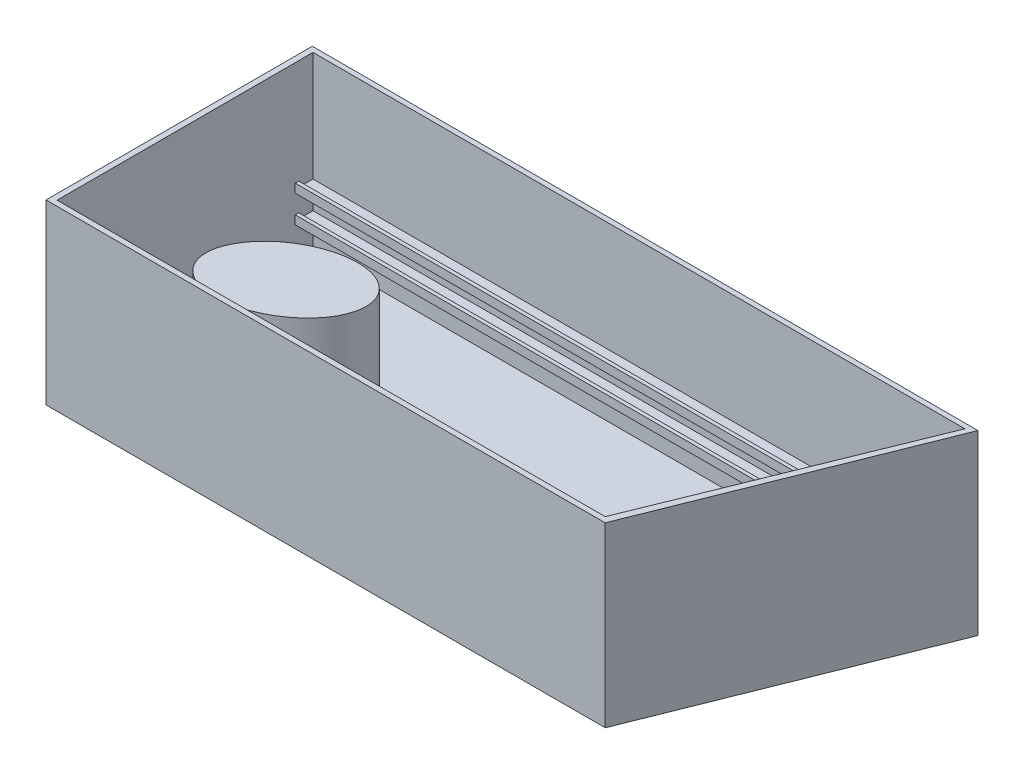
ISO-10303-21;
HEADER;
FILE_DESCRIPTION(('STEP AP214'),'2;1');
FILE_NAME('part.step','',(''),(''),'','','');
FILE_SCHEMA(('AUTOMOTIVE_DESIGN { 1 0 10303 214 1 1 1 1 }'));
ENDSEC;
DATA;
#1=APPLICATION_CONTEXT('core data for automotive mechanical design processes');
#2=APPLICATION_PROTOCOL_DEFINITION('international standard','automotive_design',2000,#1);
#3=PRODUCT_CONTEXT('',#1,'mechanical');
#4=PRODUCT('Part','Part','',(#3));
#5=PRODUCT_RELATED_PRODUCT_CATEGORY('part','',(#4));
#6=PRODUCT_DEFINITION_FORMATION('','',#4);
#7=PRODUCT_DEFINITION_CONTEXT('part definition',#1,'design');
#8=PRODUCT_DEFINITION('design','',#6,#7);
#9=PRODUCT_DEFINITION_SHAPE('','',#8);
#10=(LENGTH_UNIT() NAMED_UNIT(*) SI_UNIT(.MILLI.,.METRE.));
#11=(NAMED_UNIT(*) PLANE_ANGLE_UNIT() SI_UNIT($,.RADIAN.));
#12=(NAMED_UNIT(*) SI_UNIT($,.STERADIAN.) SOLID_ANGLE_UNIT());
#13=UNCERTAINTY_MEASURE_WITH_UNIT(LENGTH_MEASURE(1.E-05),#10,'distance_accuracy_value','');
#14=(GEOMETRIC_REPRESENTATION_CONTEXT(3) GLOBAL_UNCERTAINTY_ASSIGNED_CONTEXT((#13)) GLOBAL_UNIT_ASSIGNED_CONTEXT((#10,
#11,#12)) REPRESENTATION_CONTEXT('',''));
#15=CARTESIAN_POINT('',(0.,0.,0.));
#16=DIRECTION('',(0.,0.,1.));
#17=DIRECTION('',(1.,0.,0.));
#18=AXIS2_PLACEMENT_3D('',#15,#16,#17);
#19=CARTESIAN_POINT('',(-7919.11994074608,76.2,-3738.24281012556));
#20=DIRECTION('',(-1.,0.,0.));
#21=DIRECTION('',(0.,0.,1.));
#22=AXIS2_PLACEMENT_3D('',#19,#20,#21);
#23=PLANE('',#22);
#24=DIRECTION('',(0.,0.,-1.));
#25=VECTOR('',#24,1.);
#26=CARTESIAN_POINT('',(-7919.11994074608,922.7203129293,-3484.24281012556));
#27=LINE('',#26,#25);
#28=CARTESIAN_POINT('',(-7919.11994074608,922.7203129293,-3484.24281012556));
#29=VERTEX_POINT('',#28);
#30=CARTESIAN_POINT('',(-7919.11994074608,922.7203129293,-3738.24281012556));
#31=VERTEX_POINT('',#30);
#32=EDGE_CURVE('E271',#29,#31,#27,.T.);
#33=ORIENTED_EDGE('',*,*,#32,.F.);
#34=DIRECTION('',(0.,1.,0.));
#35=VECTOR('',#34,1.);
#36=CARTESIAN_POINT('',(-7919.11994074608,922.7203129293,-3484.24281012556));
#37=LINE('',#36,#35);
#38=CARTESIAN_POINT('',(-7919.11994074608,1047.1803129293,-3484.24281012556));
#39=VERTEX_POINT('',#38);
#40=EDGE_CURVE('E267',#29,#39,#37,.T.);
#41=ORIENTED_EDGE('',*,*,#40,.T.);
#42=DIRECTION('',(0.,0.,-1.));
#43=VECTOR('',#42,1.);
#44=CARTESIAN_POINT('',(-7919.11994074608,1047.1803129293,-3484.24281012556));
#45=LINE('',#44,#43);
#46=CARTESIAN_POINT('',(-7919.11994074608,1047.1803129293,-3535.04281012556));
#47=VERTEX_POINT('',#46);
#48=EDGE_CURVE('E279',#39,#47,#45,.T.);
#49=ORIENTED_EDGE('',*,*,#48,.T.);
#50=DIRECTION('',(0.,1.,0.));
#51=VECTOR('',#50,1.);
#52=CARTESIAN_POINT('',(-7919.11994074608,970.9803129293,-3535.04281012556));
#53=LINE('',#52,#51);
#54=CARTESIAN_POINT('',(-7919.11994074608,970.9803129293,-3535.04281012556));
#55=VERTEX_POINT('',#54);
#56=EDGE_CURVE('E246',#55,#47,#53,.T.);
#57=ORIENTED_EDGE('',*,*,#56,.F.);
#58=DIRECTION('',(0.,0.,1.));
#59=VECTOR('',#58,1.);
#60=CARTESIAN_POINT('',(-7919.11994074608,970.9803129293,-3738.24281012556));
#61=LINE('',#60,#59);
#62=CARTESIAN_POINT('',(-7919.11994074608,970.9803129293,-3738.24281012556));
#63=VERTEX_POINT('',#62);
#64=EDGE_CURVE('E234',#63,#55,#61,.T.);
#65=ORIENTED_EDGE('',*,*,#64,.F.);
#66=DIRECTION('',(0.,1.,0.));
#67=VECTOR('',#66,1.);
#68=CARTESIAN_POINT('',(-7919.11994074608,76.2,-3738.24281012556));
#69=LINE('',#68,#67);
#70=CARTESIAN_POINT('',(-7919.11994074608,2540.,-3738.24281012556));
#71=VERTEX_POINT('',#70);
#72=EDGE_CURVE('E195',#63,#71,#69,.T.);
#73=ORIENTED_EDGE('',*,*,#72,.T.);
#74=DIRECTION('',(0.,0.,1.));
#75=VECTOR('',#74,1.);
#76=CARTESIAN_POINT('',(-7919.11994074608,2540.,-3738.24281012556));
#77=LINE('',#76,#75);
#78=CARTESIAN_POINT('',(-7919.11994074608,2540.,-76.2));
#79=VERTEX_POINT('',#78);
#80=EDGE_CURVE('E328',#71,#79,#77,.T.);
#81=ORIENTED_EDGE('',*,*,#80,.T.);
#82=DIRECTION('',(0.,1.,0.));
#83=VECTOR('',#82,1.);
#84=CARTESIAN_POINT('',(-7919.11994074608,76.2,-76.2));
#85=LINE('',#84,#83);
#86=CARTESIAN_POINT('',(-7919.11994074608,76.2,-76.2));
#87=VERTEX_POINT('',#86);
#88=EDGE_CURVE('E354',#87,#79,#85,.T.);
#89=ORIENTED_EDGE('',*,*,#88,.F.);
#90=DIRECTION('',(0.,0.,1.));
#91=VECTOR('',#90,1.);
#92=CARTESIAN_POINT('',(-7919.11994074608,76.2,-3738.24281012556));
#93=LINE('',#92,#91);
#94=CARTESIAN_POINT('',(-7919.11994074608,76.2,-3738.24281012556));
#95=VERTEX_POINT('',#94);
#96=EDGE_CURVE('E336',#95,#87,#93,.T.);
#97=ORIENTED_EDGE('',*,*,#96,.F.);
#98=CARTESIAN_POINT('',(-7919.11994074608,530.642068,-3738.24281012556));
#99=VERTEX_POINT('',#98);
#100=EDGE_CURVE('E194',#95,#99,#69,.T.);
#101=ORIENTED_EDGE('',*,*,#100,.T.);
#102=DIRECTION('',(0.,0.,-1.));
#103=VECTOR('',#102,1.);
#104=CARTESIAN_POINT('',(-7919.11994074608,530.642068,-3484.24281012556));
#105=LINE('',#104,#103);
#106=CARTESIAN_POINT('',(-7919.11994074608,530.642068,-3484.24281012556));
#107=VERTEX_POINT('',#106);
#108=EDGE_CURVE('E61',#107,#99,#105,.T.);
#109=ORIENTED_EDGE('',*,*,#108,.F.);
#110=DIRECTION('',(0.,-1.,0.));
#111=VECTOR('',#110,1.);
#112=CARTESIAN_POINT('',(-7919.11994074608,530.642068,-3484.24281012556));
#113=LINE('',#112,#111);
#114=CARTESIAN_POINT('',(-7919.11994074608,654.538641515501,-3484.24281012556));
#115=VERTEX_POINT('',#114);
#116=EDGE_CURVE('E65',#115,#107,#113,.T.);
#117=ORIENTED_EDGE('',*,*,#116,.F.);
#118=DIRECTION('',(0.,0.,-1.));
#119=VECTOR('',#118,1.);
#120=CARTESIAN_POINT('',(-7919.11994074608,654.538641515501,-3484.24281012556));
#121=LINE('',#120,#119);
#122=CARTESIAN_POINT('',(-7919.11994074608,654.538641515501,-3535.04281012556));
#123=VERTEX_POINT('',#122);
#124=EDGE_CURVE('E311',#115,#123,#121,.T.);
#125=ORIENTED_EDGE('',*,*,#124,.T.);
#126=DIRECTION('',(0.,1.,0.));
#127=VECTOR('',#126,1.);
#128=CARTESIAN_POINT('',(-7919.11994074608,578.338641515501,-3535.04281012556));
#129=LINE('',#128,#127);
#130=CARTESIAN_POINT('',(-7919.11994074608,578.338641515501,-3535.04281012556));
#131=VERTEX_POINT('',#130);
#132=EDGE_CURVE('E199',#131,#123,#129,.T.);
#133=ORIENTED_EDGE('',*,*,#132,.F.);
#134=DIRECTION('',(0.,0.,1.));
#135=VECTOR('',#134,1.);
#136=CARTESIAN_POINT('',(-7919.11994074608,578.338641515501,-3738.24281012556));
#137=LINE('',#136,#135);
#138=CARTESIAN_POINT('',(-7919.11994074608,578.338641515501,-3738.24281012556));
#139=VERTEX_POINT('',#138);
#140=EDGE_CURVE('E198',#139,#131,#137,.T.);
#141=ORIENTED_EDGE('',*,*,#140,.F.);
#142=EDGE_CURVE('E183',#139,#31,#69,.T.);
#143=ORIENTED_EDGE('',*,*,#142,.T.);
#144=EDGE_LOOP('',(#33,#41,#49,#57,#65,#73,#81,#89,#97,#101,#109,#117,#125,#133,#141,#143));
#145=FACE_BOUND('',#144,.T.);
#146=ADVANCED_FACE('F45',(#145),#23,.F.);
#147=CARTESIAN_POINT('',(1408.68694116932,76.2,-3738.24281012556));
#148=DIRECTION('',(0.,0.,-1.));
#149=DIRECTION('',(-1.,0.,0.));
#150=AXIS2_PLACEMENT_3D('',#147,#148,#149);
#151=PLANE('',#150);
#152=DIRECTION('',(1.,0.,0.));
#153=VECTOR('',#152,1.);
#154=CARTESIAN_POINT('',(-7919.11994074608,922.7203129293,-3738.24281012556));
#155=LINE('',#154,#153);
#156=CARTESIAN_POINT('',(-730.538940746078,922.7203129293,-3738.24281012556));
#157=VERTEX_POINT('',#156);
#158=EDGE_CURVE('E191',#31,#157,#155,.T.);
#159=ORIENTED_EDGE('',*,*,#158,.F.);
#160=ORIENTED_EDGE('',*,*,#142,.F.);
#161=DIRECTION('',(-1.,0.,0.));
#162=VECTOR('',#161,1.);
#163=CARTESIAN_POINT('',(-730.518043686203,578.338641515501,-3738.24281012556));
#164=LINE('',#163,#162);
#165=CARTESIAN_POINT('',(-730.518043686203,578.338641515501,-3738.24281012556));
#166=VERTEX_POINT('',#165);
#167=EDGE_CURVE('E187',#166,#139,#164,.T.);
#168=ORIENTED_EDGE('',*,*,#167,.F.);
#169=DIRECTION('',(0.,1.,0.));
#170=VECTOR('',#169,1.);
#171=CARTESIAN_POINT('',(-730.518043686203,654.538641515501,-3738.24281012556));
#172=LINE('',#171,#170);
#173=CARTESIAN_POINT('',(-730.518043686203,530.642068,-3738.24281012556));
#174=VERTEX_POINT('',#173);
#175=EDGE_CURVE('E296',#174,#166,#172,.T.);
#176=ORIENTED_EDGE('',*,*,#175,.F.);
#177=DIRECTION('',(1.,0.,0.));
#178=VECTOR('',#177,1.);
#179=CARTESIAN_POINT('',(-730.518043686203,530.642068,-3738.24281012556));
#180=LINE('',#179,#178);
#181=EDGE_CURVE('E290',#99,#174,#180,.T.);
#182=ORIENTED_EDGE('',*,*,#181,.F.);
#183=ORIENTED_EDGE('',*,*,#100,.F.);
#184=DIRECTION('',(-1.,0.,0.));
#185=VECTOR('',#184,1.);
#186=CARTESIAN_POINT('',(1408.68694116932,76.2,-3738.24281012556));
#187=LINE('',#186,#185);
#188=CARTESIAN_POINT('',(1408.68694116932,76.2,-3738.24281012556));
#189=VERTEX_POINT('',#188);
#190=EDGE_CURVE('E332',#189,#95,#187,.T.);
#191=ORIENTED_EDGE('',*,*,#190,.F.);
#192=DIRECTION('',(0.,1.,0.));
#193=VECTOR('',#192,1.);
#194=CARTESIAN_POINT('',(1408.68694116932,76.2,-3738.24281012556));
#195=LINE('',#194,#193);
#196=CARTESIAN_POINT('',(1408.68694116932,2540.,-3738.24281012556));
#197=VERTEX_POINT('',#196);
#198=EDGE_CURVE('E359',#189,#197,#195,.T.);
#199=ORIENTED_EDGE('',*,*,#198,.T.);
#200=DIRECTION('',(-1.,0.,0.));
#201=VECTOR('',#200,1.);
#202=CARTESIAN_POINT('',(1408.68694116932,2540.,-3738.24281012556));
#203=LINE('',#202,#201);
#204=EDGE_CURVE('E347',#197,#71,#203,.T.);
#205=ORIENTED_EDGE('',*,*,#204,.T.);
#206=ORIENTED_EDGE('',*,*,#72,.F.);
#207=DIRECTION('',(-1.,0.,0.));
#208=VECTOR('',#207,1.);
#209=CARTESIAN_POINT('',(-730.538940746078,970.9803129293,-3738.24281012556));
#210=LINE('',#209,#208);
#211=CARTESIAN_POINT('',(-730.538940746078,970.9803129293,-3738.24281012556));
#212=VERTEX_POINT('',#211);
#213=EDGE_CURVE('E230',#212,#63,#210,.T.);
#214=ORIENTED_EDGE('',*,*,#213,.F.);
#215=DIRECTION('',(0.,1.,0.));
#216=VECTOR('',#215,1.);
#217=CARTESIAN_POINT('',(-730.538940746078,922.7203129293,-3738.24281012556));
#218=LINE('',#217,#216);
#219=EDGE_CURVE('E260',#157,#212,#218,.T.);
#220=ORIENTED_EDGE('',*,*,#219,.F.);
#221=EDGE_LOOP('',(#159,#160,#168,#176,#182,#183,#191,#199,#205,#206,#214,#220));
#222=FACE_BOUND('',#221,.T.);
#223=ADVANCED_FACE('F185',(#222),#151,.F.);
#224=CARTESIAN_POINT('',(1524.,2540.,-3810.));
#225=DIRECTION('',(-0.928476690885259,0.,-0.371390676354104));
#226=DIRECTION('',(-0.371390676354104,0.,0.928476690885259));
#227=AXIS2_PLACEMENT_3D('',#224,#225,#226);
#228=PLANE('',#227);
#229=DIRECTION('',(0.371390676354104,0.,-0.928476690885259));
#230=VECTOR('',#229,1.);
#231=CARTESIAN_POINT('',(1524.,0.,-3810.));
#232=LINE('',#231,#230);
#233=CARTESIAN_POINT('',(0.,0.,0.));
#234=VERTEX_POINT('',#233);
#235=CARTESIAN_POINT('',(1524.,0.,-3810.));
#236=VERTEX_POINT('',#235);
#237=EDGE_CURVE('E356',#234,#236,#232,.T.);
#238=ORIENTED_EDGE('',*,*,#237,.T.);
#239=DIRECTION('',(0.,-1.,0.));
#240=VECTOR('',#239,1.);
#241=CARTESIAN_POINT('',(1524.,2540.,-3810.));
#242=LINE('',#241,#240);
#243=CARTESIAN_POINT('',(1524.,2540.,-3810.));
#244=VERTEX_POINT('',#243);
#245=EDGE_CURVE('E54',#244,#236,#242,.T.);
#246=ORIENTED_EDGE('',*,*,#245,.F.);
#247=DIRECTION('',(0.371390676354104,0.,-0.928476690885259));
#248=VECTOR('',#247,1.);
#249=CARTESIAN_POINT('',(1524.,2540.,-3810.));
#250=LINE('',#249,#248);
#251=CARTESIAN_POINT('',(0.,2540.,0.));
#252=VERTEX_POINT('',#251);
#253=EDGE_CURVE('E365',#252,#244,#250,.T.);
#254=ORIENTED_EDGE('',*,*,#253,.F.);
#255=DIRECTION('',(0.,-1.,0.));
#256=VECTOR('',#255,1.);
#257=CARTESIAN_POINT('',(0.,2540.,0.));
#258=LINE('',#257,#256);
#259=EDGE_CURVE('E379',#252,#234,#258,.T.);
#260=ORIENTED_EDGE('',*,*,#259,.T.);
#261=EDGE_LOOP('',(#238,#246,#254,#260));
#262=FACE_BOUND('',#261,.T.);
#263=ADVANCED_FACE('F47',(#262),#228,.F.);
#264=CARTESIAN_POINT('',(-8001.,2540.,-3810.));
#265=DIRECTION('',(0.,0.,1.));
#266=DIRECTION('',(1.,0.,0.));
#267=AXIS2_PLACEMENT_3D('',#264,#265,#266);
#268=PLANE('',#267);
#269=DIRECTION('',(-1.,0.,0.));
#270=VECTOR('',#269,1.);
#271=CARTESIAN_POINT('',(-8001.,0.,-3810.));
#272=LINE('',#271,#270);
#273=CARTESIAN_POINT('',(-8001.,0.,-3810.));
#274=VERTEX_POINT('',#273);
#275=EDGE_CURVE('E383',#236,#274,#272,.T.);
#276=ORIENTED_EDGE('',*,*,#275,.T.);
#277=DIRECTION('',(0.,-1.,0.));
#278=VECTOR('',#277,1.);
#279=CARTESIAN_POINT('',(-8001.,2540.,-3810.));
#280=LINE('',#279,#278);
#281=CARTESIAN_POINT('',(-8001.,2540.,-3810.));
#282=VERTEX_POINT('',#281);
#283=EDGE_CURVE('E398',#282,#274,#280,.T.);
#284=ORIENTED_EDGE('',*,*,#283,.F.);
#285=DIRECTION('',(-1.,0.,0.));
#286=VECTOR('',#285,1.);
#287=CARTESIAN_POINT('',(-8001.,2540.,-3810.));
#288=LINE('',#287,#286);
#289=EDGE_CURVE('E369',#244,#282,#288,.T.);
#290=ORIENTED_EDGE('',*,*,#289,.F.);
#291=ORIENTED_EDGE('',*,*,#245,.T.);
#292=EDGE_LOOP('',(#276,#284,#290,#291));
#293=FACE_BOUND('',#292,.T.);
#294=ADVANCED_FACE('F405',(#293),#268,.F.);
#295=CARTESIAN_POINT('',(-8001.,2540.,9.79839903997797E-13));
#296=DIRECTION('',(1.,0.,0.));
#297=DIRECTION('',(0.,0.,-1.));
#298=AXIS2_PLACEMENT_3D('',#295,#296,#297);
#299=PLANE('',#298);
#300=DIRECTION('',(0.,0.,1.));
#301=VECTOR('',#300,1.);
#302=CARTESIAN_POINT('',(-8001.,0.,9.79839903997797E-13));
#303=LINE('',#302,#301);
#304=CARTESIAN_POINT('',(-8001.,0.,9.79839903997797E-13));
#305=VERTEX_POINT('',#304);
#306=EDGE_CURVE('E386',#274,#305,#303,.T.);
#307=ORIENTED_EDGE('',*,*,#306,.T.);
#308=DIRECTION('',(0.,-1.,0.));
#309=VECTOR('',#308,1.);
#310=CARTESIAN_POINT('',(-8001.,2540.,9.79839903997797E-13));
#311=LINE('',#310,#309);
#312=CARTESIAN_POINT('',(-8001.,2540.,9.79839903997797E-13));
#313=VERTEX_POINT('',#312);
#314=EDGE_CURVE('E394',#313,#305,#311,.T.);
#315=ORIENTED_EDGE('',*,*,#314,.F.);
#316=DIRECTION('',(0.,0.,1.));
#317=VECTOR('',#316,1.);
#318=CARTESIAN_POINT('',(-8001.,2540.,9.79839903997797E-13));
#319=LINE('',#318,#317);
#320=EDGE_CURVE('E373',#282,#313,#319,.T.);
#321=ORIENTED_EDGE('',*,*,#320,.F.);
#322=ORIENTED_EDGE('',*,*,#283,.T.);
#323=EDGE_LOOP('',(#307,#315,#321,#322));
#324=FACE_BOUND('',#323,.T.);
#325=ADVANCED_FACE('F417',(#324),#299,.F.);
#326=CARTESIAN_POINT('',(0.,2540.,0.));
#327=DIRECTION('',(0.,0.,-1.));
#328=DIRECTION('',(-1.,0.,0.));
#329=AXIS2_PLACEMENT_3D('',#326,#327,#328);
#330=PLANE('',#329);
#331=DIRECTION('',(1.,0.,0.));
#332=VECTOR('',#331,1.);
#333=CARTESIAN_POINT('',(0.,0.,0.));
#334=LINE('',#333,#332);
#335=EDGE_CURVE('E370',#305,#234,#334,.T.);
#336=ORIENTED_EDGE('',*,*,#335,.T.);
#337=ORIENTED_EDGE('',*,*,#259,.F.);
#338=DIRECTION('',(1.,0.,0.));
#339=VECTOR('',#338,1.);
#340=CARTESIAN_POINT('',(0.,2540.,0.));
#341=LINE('',#340,#339);
#342=EDGE_CURVE('E376',#313,#252,#341,.T.);
#343=ORIENTED_EDGE('',*,*,#342,.F.);
#344=ORIENTED_EDGE('',*,*,#314,.T.);
#345=EDGE_LOOP('',(#336,#337,#343,#344));
#346=FACE_BOUND('',#345,.T.);
#347=ADVANCED_FACE('F421',(#346),#330,.F.);
#348=CARTESIAN_POINT('',(0.,2540.,0.));
#349=DIRECTION('',(0.,-1.,0.));
#350=DIRECTION('',(0.,0.,-1.));
#351=AXIS2_PLACEMENT_3D('',#348,#349,#350);
#352=PLANE('',#351);
#353=DIRECTION('',(0.375764874288312,0.,-0.926715036702809));
#354=VECTOR('',#353,1.);
#355=CARTESIAN_POINT('',(-76.2,2540.,-76.2));
#356=LINE('',#355,#354);
#357=CARTESIAN_POINT('',(-76.2,2540.,-76.2));
#358=VERTEX_POINT('',#357);
#359=EDGE_CURVE('E343',#358,#197,#356,.T.);
#360=ORIENTED_EDGE('',*,*,#359,.F.);
#361=DIRECTION('',(1.,0.,0.));
#362=VECTOR('',#361,1.);
#363=CARTESIAN_POINT('',(-7919.11994074608,2540.,-76.2));
#364=LINE('',#363,#362);
#365=EDGE_CURVE('E322',#79,#358,#364,.T.);
#366=ORIENTED_EDGE('',*,*,#365,.F.);
#367=ORIENTED_EDGE('',*,*,#80,.F.);
#368=ORIENTED_EDGE('',*,*,#204,.F.);
#369=EDGE_LOOP('',(#360,#366,#367,#368));
#370=FACE_BOUND('',#369,.T.);
#371=ORIENTED_EDGE('',*,*,#253,.T.);
#372=ORIENTED_EDGE('',*,*,#289,.T.);
#373=ORIENTED_EDGE('',*,*,#320,.T.);
#374=ORIENTED_EDGE('',*,*,#342,.T.);
#375=EDGE_LOOP('',(#371,#372,#373,#374));
#376=FACE_BOUND('',#375,.T.);
#377=ADVANCED_FACE('F423',(#370,#376),#352,.F.);
#378=CARTESIAN_POINT('',(0.,0.,0.));
#379=DIRECTION('',(0.,-1.,0.));
#380=DIRECTION('',(0.,0.,-1.));
#381=AXIS2_PLACEMENT_3D('',#378,#379,#380);
#382=PLANE('',#381);
#383=ORIENTED_EDGE('',*,*,#237,.F.);
#384=ORIENTED_EDGE('',*,*,#335,.F.);
#385=ORIENTED_EDGE('',*,*,#306,.F.);
#386=ORIENTED_EDGE('',*,*,#275,.F.);
#387=EDGE_LOOP('',(#383,#384,#385,#386));
#388=FACE_BOUND('',#387,.T.);
#389=ADVANCED_FACE('F413',(#388),#382,.T.);
#390=CARTESIAN_POINT('',(-7919.11994074608,76.2,-76.2));
#391=DIRECTION('',(0.,0.,1.));
#392=DIRECTION('',(1.,0.,0.));
#393=AXIS2_PLACEMENT_3D('',#390,#391,#392);
#394=PLANE('',#393);
#395=ORIENTED_EDGE('',*,*,#365,.T.);
#396=DIRECTION('',(0.,1.,0.));
#397=VECTOR('',#396,1.);
#398=CARTESIAN_POINT('',(-76.2,76.2,-76.2));
#399=LINE('',#398,#397);
#400=CARTESIAN_POINT('',(-76.2,76.2,-76.2));
#401=VERTEX_POINT('',#400);
#402=EDGE_CURVE('E340',#401,#358,#399,.T.);
#403=ORIENTED_EDGE('',*,*,#402,.F.);
#404=DIRECTION('',(1.,0.,0.));
#405=VECTOR('',#404,1.);
#406=CARTESIAN_POINT('',(-7919.11994074608,76.2,-76.2));
#407=LINE('',#406,#405);
#408=EDGE_CURVE('E323',#87,#401,#407,.T.);
#409=ORIENTED_EDGE('',*,*,#408,.F.);
#410=ORIENTED_EDGE('',*,*,#88,.T.);
#411=EDGE_LOOP('',(#395,#403,#409,#410));
#412=FACE_BOUND('',#411,.T.);
#413=ADVANCED_FACE('F431',(#412),#394,.F.);
#414=CARTESIAN_POINT('',(-76.2,76.2,-76.2));
#415=DIRECTION('',(0.926715036702809,0.,0.375764874288313));
#416=DIRECTION('',(0.375764874288313,0.,-0.926715036702809));
#417=AXIS2_PLACEMENT_3D('',#414,#415,#416);
#418=PLANE('',#417);
#419=ORIENTED_EDGE('',*,*,#359,.T.);
#420=ORIENTED_EDGE('',*,*,#198,.F.);
#421=DIRECTION('',(0.375764874288312,0.,-0.926715036702809));
#422=VECTOR('',#421,1.);
#423=CARTESIAN_POINT('',(-76.2,76.2,-76.2));
#424=LINE('',#423,#422);
#425=EDGE_CURVE('E327',#401,#189,#424,.T.);
#426=ORIENTED_EDGE('',*,*,#425,.F.);
#427=ORIENTED_EDGE('',*,*,#402,.T.);
#428=EDGE_LOOP('',(#419,#420,#426,#427));
#429=FACE_BOUND('',#428,.T.);
#430=ADVANCED_FACE('F448',(#429),#418,.F.);
#431=CARTESIAN_POINT('',(0.,76.2,0.));
#432=DIRECTION('',(0.,-1.,0.));
#433=DIRECTION('',(0.,0.,-1.));
#434=AXIS2_PLACEMENT_3D('',#431,#432,#433);
#435=PLANE('',#434);
#436=CARTESIAN_POINT('',(-5727.95127198943,76.2,-1161.666204476));
#437=DIRECTION('',(0.,1.,0.));
#438=DIRECTION('',(0.883715045401305,0.,-0.468025339625292));
#439=AXIS2_PLACEMENT_3D('',#436,#437,#438);
#440=ELLIPSE('',#439,966.922200264,638.624638674);
#441=CARTESIAN_POINT('',(-4873.4675758836,76.2,-1614.21029564579));
#442=VERTEX_POINT('',#441);
#443=EDGE_CURVE('E11',#442,#442,#440,.T.);
#444=ORIENTED_EDGE('',*,*,#443,.F.);
#445=EDGE_LOOP('',(#444));
#446=FACE_BOUND('',#445,.T.);
#447=ORIENTED_EDGE('',*,*,#408,.T.);
#448=ORIENTED_EDGE('',*,*,#425,.T.);
#449=ORIENTED_EDGE('',*,*,#190,.T.);
#450=ORIENTED_EDGE('',*,*,#96,.T.);
#451=EDGE_LOOP('',(#447,#448,#449,#450));
#452=FACE_BOUND('',#451,.T.);
#453=ADVANCED_FACE('F445',(#446,#452),#435,.F.);
#454=CARTESIAN_POINT('',(-730.518043686203,530.642068,-3484.24281012556));
#455=DIRECTION('',(0.,1.,0.));
#456=DIRECTION('',(0.,0.,1.));
#457=AXIS2_PLACEMENT_3D('',#454,#455,#456);
#458=PLANE('',#457);
#459=ORIENTED_EDGE('',*,*,#181,.T.);
#460=DIRECTION('',(0.,0.,-1.));
#461=VECTOR('',#460,1.);
#462=CARTESIAN_POINT('',(-730.518043686203,530.642068,-3484.24281012556));
#463=LINE('',#462,#461);
#464=CARTESIAN_POINT('',(-730.518043686203,530.642068,-3484.24281012556));
#465=VERTEX_POINT('',#464);
#466=EDGE_CURVE('E318',#465,#174,#463,.T.);
#467=ORIENTED_EDGE('',*,*,#466,.F.);
#468=DIRECTION('',(1.,0.,0.));
#469=VECTOR('',#468,1.);
#470=CARTESIAN_POINT('',(-730.518043686203,530.642068,-3484.24281012556));
#471=LINE('',#470,#469);
#472=EDGE_CURVE('E291',#107,#465,#471,.T.);
#473=ORIENTED_EDGE('',*,*,#472,.F.);
#474=ORIENTED_EDGE('',*,*,#108,.T.);
#475=EDGE_LOOP('',(#459,#467,#473,#474));
#476=FACE_BOUND('',#475,.T.);
#477=ADVANCED_FACE('F509',(#476),#458,.F.);
#478=CARTESIAN_POINT('',(-730.518043686203,654.538641515501,-3484.24281012556));
#479=DIRECTION('',(-1.,0.,0.));
#480=DIRECTION('',(0.,0.,1.));
#481=AXIS2_PLACEMENT_3D('',#478,#479,#480);
#482=PLANE('',#481);
#483=DIRECTION('',(0.,0.,-1.));
#484=VECTOR('',#483,1.);
#485=CARTESIAN_POINT('',(-730.518043686203,578.338641515501,-3535.04281012556));
#486=LINE('',#485,#484);
#487=CARTESIAN_POINT('',(-730.518043686203,578.338641515501,-3535.04281012556));
#488=VERTEX_POINT('',#487);
#489=EDGE_CURVE('E208',#488,#166,#486,.T.);
#490=ORIENTED_EDGE('',*,*,#489,.F.);
#491=DIRECTION('',(0.,1.,0.));
#492=VECTOR('',#491,1.);
#493=CARTESIAN_POINT('',(-730.518043686203,578.338641515501,-3535.04281012556));
#494=LINE('',#493,#492);
#495=CARTESIAN_POINT('',(-730.518043686203,654.538641515501,-3535.04281012556));
#496=VERTEX_POINT('',#495);
#497=EDGE_CURVE('E223',#488,#496,#494,.T.);
#498=ORIENTED_EDGE('',*,*,#497,.T.);
#499=DIRECTION('',(0.,0.,-1.));
#500=VECTOR('',#499,1.);
#501=CARTESIAN_POINT('',(-730.518043686203,654.538641515501,-3484.24281012556));
#502=LINE('',#501,#500);
#503=CARTESIAN_POINT('',(-730.518043686203,654.538641515501,-3484.24281012556));
#504=VERTEX_POINT('',#503);
#505=EDGE_CURVE('E314',#504,#496,#502,.T.);
#506=ORIENTED_EDGE('',*,*,#505,.F.);
#507=DIRECTION('',(0.,1.,0.));
#508=VECTOR('',#507,1.);
#509=CARTESIAN_POINT('',(-730.518043686203,654.538641515501,-3484.24281012556));
#510=LINE('',#509,#508);
#511=EDGE_CURVE('E295',#465,#504,#510,.T.);
#512=ORIENTED_EDGE('',*,*,#511,.F.);
#513=ORIENTED_EDGE('',*,*,#466,.T.);
#514=ORIENTED_EDGE('',*,*,#175,.T.);
#515=EDGE_LOOP('',(#490,#498,#506,#512,#513,#514));
#516=FACE_BOUND('',#515,.T.);
#517=ADVANCED_FACE('F506',(#516),#482,.F.);
#518=CARTESIAN_POINT('',(-7919.11994074608,654.538641515501,-3484.24281012556));
#519=DIRECTION('',(0.,-1.,0.));
#520=DIRECTION('',(0.,0.,-1.));
#521=AXIS2_PLACEMENT_3D('',#518,#519,#520);
#522=PLANE('',#521);
#523=ORIENTED_EDGE('',*,*,#505,.T.);
#524=DIRECTION('',(1.,0.,0.));
#525=VECTOR('',#524,1.);
#526=CARTESIAN_POINT('',(-7919.11994074608,654.538641515501,-3535.04281012556));
#527=LINE('',#526,#525);
#528=EDGE_CURVE('E211',#123,#496,#527,.T.);
#529=ORIENTED_EDGE('',*,*,#528,.F.);
#530=ORIENTED_EDGE('',*,*,#124,.F.);
#531=DIRECTION('',(-1.,0.,0.));
#532=VECTOR('',#531,1.);
#533=CARTESIAN_POINT('',(-7919.11994074608,654.538641515501,-3484.24281012556));
#534=LINE('',#533,#532);
#535=EDGE_CURVE('E299',#504,#115,#534,.T.);
#536=ORIENTED_EDGE('',*,*,#535,.F.);
#537=EDGE_LOOP('',(#523,#529,#530,#536));
#538=FACE_BOUND('',#537,.T.);
#539=ADVANCED_FACE('F502',(#538),#522,.F.);
#540=CARTESIAN_POINT('',(0.,0.,-3484.24281012556));
#541=DIRECTION('',(0.,0.,-1.));
#542=DIRECTION('',(-1.,0.,0.));
#543=AXIS2_PLACEMENT_3D('',#540,#541,#542);
#544=PLANE('',#543);
#545=ORIENTED_EDGE('',*,*,#472,.T.);
#546=ORIENTED_EDGE('',*,*,#511,.T.);
#547=ORIENTED_EDGE('',*,*,#535,.T.);
#548=ORIENTED_EDGE('',*,*,#116,.T.);
#549=EDGE_LOOP('',(#545,#546,#547,#548));
#550=FACE_BOUND('',#549,.T.);
#551=ADVANCED_FACE('F499',(#550),#544,.F.);
#552=CARTESIAN_POINT('',(-7919.11994074608,922.7203129293,-3484.24281012556));
#553=DIRECTION('',(0.,1.,0.));
#554=DIRECTION('',(0.,0.,1.));
#555=AXIS2_PLACEMENT_3D('',#552,#553,#554);
#556=PLANE('',#555);
#557=ORIENTED_EDGE('',*,*,#158,.T.);
#558=DIRECTION('',(0.,0.,-1.));
#559=VECTOR('',#558,1.);
#560=CARTESIAN_POINT('',(-730.538940746078,922.7203129293,-3484.24281012556));
#561=LINE('',#560,#559);
#562=CARTESIAN_POINT('',(-730.538940746078,922.7203129293,-3484.24281012556));
#563=VERTEX_POINT('',#562);
#564=EDGE_CURVE('E287',#563,#157,#561,.T.);
#565=ORIENTED_EDGE('',*,*,#564,.F.);
#566=DIRECTION('',(1.,0.,0.));
#567=VECTOR('',#566,1.);
#568=CARTESIAN_POINT('',(-7919.11994074608,922.7203129293,-3484.24281012556));
#569=LINE('',#568,#567);
#570=EDGE_CURVE('E255',#29,#563,#569,.T.);
#571=ORIENTED_EDGE('',*,*,#570,.F.);
#572=ORIENTED_EDGE('',*,*,#32,.T.);
#573=EDGE_LOOP('',(#557,#565,#571,#572));
#574=FACE_BOUND('',#573,.T.);
#575=ADVANCED_FACE('F473',(#574),#556,.F.);
#576=CARTESIAN_POINT('',(-730.538940746078,922.7203129293,-3484.24281012556));
#577=DIRECTION('',(-1.,0.,0.));
#578=DIRECTION('',(0.,0.,1.));
#579=AXIS2_PLACEMENT_3D('',#576,#577,#578);
#580=PLANE('',#579);
#581=DIRECTION('',(0.,0.,-1.));
#582=VECTOR('',#581,1.);
#583=CARTESIAN_POINT('',(-730.538940746078,970.9803129293,-3535.04281012556));
#584=LINE('',#583,#582);
#585=CARTESIAN_POINT('',(-730.538940746078,970.9803129293,-3535.04281012556));
#586=VERTEX_POINT('',#585);
#587=EDGE_CURVE('E242',#586,#212,#584,.T.);
#588=ORIENTED_EDGE('',*,*,#587,.F.);
#589=DIRECTION('',(0.,1.,0.));
#590=VECTOR('',#589,1.);
#591=CARTESIAN_POINT('',(-730.538940746078,970.9803129293,-3535.04281012556));
#592=LINE('',#591,#590);
#593=CARTESIAN_POINT('',(-730.538940746078,1047.1803129293,-3535.04281012556));
#594=VERTEX_POINT('',#593);
#595=EDGE_CURVE('E249',#586,#594,#592,.T.);
#596=ORIENTED_EDGE('',*,*,#595,.T.);
#597=DIRECTION('',(0.,0.,-1.));
#598=VECTOR('',#597,1.);
#599=CARTESIAN_POINT('',(-730.538940746078,1047.1803129293,-3484.24281012556));
#600=LINE('',#599,#598);
#601=CARTESIAN_POINT('',(-730.538940746078,1047.1803129293,-3484.24281012556));
#602=VERTEX_POINT('',#601);
#603=EDGE_CURVE('E283',#602,#594,#600,.T.);
#604=ORIENTED_EDGE('',*,*,#603,.F.);
#605=DIRECTION('',(0.,1.,0.));
#606=VECTOR('',#605,1.);
#607=CARTESIAN_POINT('',(-730.538940746078,922.7203129293,-3484.24281012556));
#608=LINE('',#607,#606);
#609=EDGE_CURVE('E259',#563,#602,#608,.T.);
#610=ORIENTED_EDGE('',*,*,#609,.F.);
#611=ORIENTED_EDGE('',*,*,#564,.T.);
#612=ORIENTED_EDGE('',*,*,#219,.T.);
#613=EDGE_LOOP('',(#588,#596,#604,#610,#611,#612));
#614=FACE_BOUND('',#613,.T.);
#615=ADVANCED_FACE('F469',(#614),#580,.F.);
#616=CARTESIAN_POINT('',(-7919.11994074608,1047.1803129293,-3484.24281012556));
#617=DIRECTION('',(0.,1.,0.));
#618=DIRECTION('',(0.,0.,1.));
#619=AXIS2_PLACEMENT_3D('',#616,#617,#618);
#620=PLANE('',#619);
#621=DIRECTION('',(1.,0.,0.));
#622=VECTOR('',#621,1.);
#623=CARTESIAN_POINT('',(-7919.11994074608,1047.1803129293,-3535.04281012556));
#624=LINE('',#623,#622);
#625=EDGE_CURVE('E227',#47,#594,#624,.T.);
#626=ORIENTED_EDGE('',*,*,#625,.F.);
#627=ORIENTED_EDGE('',*,*,#48,.F.);
#628=DIRECTION('',(1.,0.,0.));
#629=VECTOR('',#628,1.);
#630=CARTESIAN_POINT('',(-7919.11994074608,1047.1803129293,-3484.24281012556));
#631=LINE('',#630,#629);
#632=EDGE_CURVE('E263',#39,#602,#631,.T.);
#633=ORIENTED_EDGE('',*,*,#632,.T.);
#634=ORIENTED_EDGE('',*,*,#603,.T.);
#635=EDGE_LOOP('',(#626,#627,#633,#634));
#636=FACE_BOUND('',#635,.T.);
#637=ADVANCED_FACE('F480',(#636),#620,.T.);
#638=CARTESIAN_POINT('',(0.,0.,-3484.24281012556));
#639=DIRECTION('',(0.,0.,1.));
#640=DIRECTION('',(1.,0.,0.));
#641=AXIS2_PLACEMENT_3D('',#638,#639,#640);
#642=PLANE('',#641);
#643=ORIENTED_EDGE('',*,*,#570,.T.);
#644=ORIENTED_EDGE('',*,*,#609,.T.);
#645=ORIENTED_EDGE('',*,*,#632,.F.);
#646=ORIENTED_EDGE('',*,*,#40,.F.);
#647=EDGE_LOOP('',(#643,#644,#645,#646));
#648=FACE_BOUND('',#647,.T.);
#649=ADVANCED_FACE('F477',(#648),#642,.T.);
#650=CARTESIAN_POINT('',(-7919.11994074608,970.9803129293,-3535.04281012556));
#651=DIRECTION('',(0.,0.,1.));
#652=DIRECTION('',(1.,0.,0.));
#653=AXIS2_PLACEMENT_3D('',#650,#651,#652);
#654=PLANE('',#653);
#655=ORIENTED_EDGE('',*,*,#625,.T.);
#656=ORIENTED_EDGE('',*,*,#595,.F.);
#657=DIRECTION('',(1.,0.,0.));
#658=VECTOR('',#657,1.);
#659=CARTESIAN_POINT('',(-7919.11994074608,970.9803129293,-3535.04281012556));
#660=LINE('',#659,#658);
#661=EDGE_CURVE('E238',#55,#586,#660,.T.);
#662=ORIENTED_EDGE('',*,*,#661,.F.);
#663=ORIENTED_EDGE('',*,*,#56,.T.);
#664=EDGE_LOOP('',(#655,#656,#662,#663));
#665=FACE_BOUND('',#664,.T.);
#666=ADVANCED_FACE('F482',(#665),#654,.F.);
#667=CARTESIAN_POINT('',(0.,970.9803129293,0.));
#668=DIRECTION('',(0.,1.,0.));
#669=DIRECTION('',(0.,0.,1.));
#670=AXIS2_PLACEMENT_3D('',#667,#668,#669);
#671=PLANE('',#670);
#672=ORIENTED_EDGE('',*,*,#213,.T.);
#673=ORIENTED_EDGE('',*,*,#64,.T.);
#674=ORIENTED_EDGE('',*,*,#661,.T.);
#675=ORIENTED_EDGE('',*,*,#587,.T.);
#676=EDGE_LOOP('',(#672,#673,#674,#675));
#677=FACE_BOUND('',#676,.T.);
#678=ADVANCED_FACE('F466',(#677),#671,.T.);
#679=CARTESIAN_POINT('',(-7919.11994074608,578.338641515501,-3535.04281012556));
#680=DIRECTION('',(0.,0.,1.));
#681=DIRECTION('',(1.,0.,0.));
#682=AXIS2_PLACEMENT_3D('',#679,#680,#681);
#683=PLANE('',#682);
#684=ORIENTED_EDGE('',*,*,#528,.T.);
#685=ORIENTED_EDGE('',*,*,#497,.F.);
#686=DIRECTION('',(1.,0.,0.));
#687=VECTOR('',#686,1.);
#688=CARTESIAN_POINT('',(-7919.11994074608,578.338641515501,-3535.04281012556));
#689=LINE('',#688,#687);
#690=EDGE_CURVE('E204',#131,#488,#689,.T.);
#691=ORIENTED_EDGE('',*,*,#690,.F.);
#692=ORIENTED_EDGE('',*,*,#132,.T.);
#693=EDGE_LOOP('',(#684,#685,#691,#692));
#694=FACE_BOUND('',#693,.T.);
#695=ADVANCED_FACE('F488',(#694),#683,.F.);
#696=CARTESIAN_POINT('',(0.,578.338641515501,0.));
#697=DIRECTION('',(0.,1.,0.));
#698=DIRECTION('',(0.,0.,1.));
#699=AXIS2_PLACEMENT_3D('',#696,#697,#698);
#700=PLANE('',#699);
#701=ORIENTED_EDGE('',*,*,#167,.T.);
#702=ORIENTED_EDGE('',*,*,#140,.T.);
#703=ORIENTED_EDGE('',*,*,#690,.T.);
#704=ORIENTED_EDGE('',*,*,#489,.T.);
#705=EDGE_LOOP('',(#701,#702,#703,#704));
#706=FACE_BOUND('',#705,.T.);
#707=ADVANCED_FACE('F206',(#706),#700,.T.);
#708=CARTESIAN_POINT('',(-5727.95127198943,2108.2,-1161.666204476));
#709=DIRECTION('',(0.,1.,0.));
#710=DIRECTION('',(0.883715045401305,0.,-0.468025339625292));
#711=AXIS2_PLACEMENT_3D('',#708,#709,#710);
#712=ELLIPSE('',#711,966.922200264,638.624638674);
#713=DIRECTION('',(0.,-1.,0.));
#714=VECTOR('',#713,1.);
#715=SURFACE_OF_LINEAR_EXTRUSION('',#712,#714);
#716=CARTESIAN_POINT('',(-4873.4675758836,2108.2,-1614.21029564579));
#717=VERTEX_POINT('',#716);
#718=EDGE_CURVE('E214',#717,#717,#712,.T.);
#719=ORIENTED_EDGE('',*,*,#718,.F.);
#720=EDGE_LOOP('',(#719));
#721=FACE_BOUND('',#720,.T.);
#722=ORIENTED_EDGE('',*,*,#443,.T.);
#723=EDGE_LOOP('',(#722));
#724=FACE_BOUND('',#723,.T.);
#725=ADVANCED_FACE('F528',(#721,#724),#715,.F.);
#726=CARTESIAN_POINT('',(-5727.95127198943,2108.2,-1161.666204476));
#727=DIRECTION('',(0.,1.,0.));
#728=DIRECTION('',(0.,0.,1.));
#729=AXIS2_PLACEMENT_3D('',#726,#727,#728);
#730=PLANE('',#729);
#731=ORIENTED_EDGE('',*,*,#718,.T.);
#732=EDGE_LOOP('',(#731));
#733=FACE_BOUND('',#732,.T.);
#734=ADVANCED_FACE('F533',(#733),#730,.T.);
#735=CLOSED_SHELL('',(#146,#223,#263,#294,#325,#347,#377,#389,#413,#430,#453,#477,#517,#539,
#551,#575,#615,#637,#649,#666,#678,#695,#707,#725,#734));
#736=MANIFOLD_SOLID_BREP('B2',#735);
#737=ADVANCED_BREP_SHAPE_REPRESENTATION('',(#18,#736),#14);
#738=SHAPE_DEFINITION_REPRESENTATION(#9,#737);
ENDSEC;
END-ISO-10303-21;
